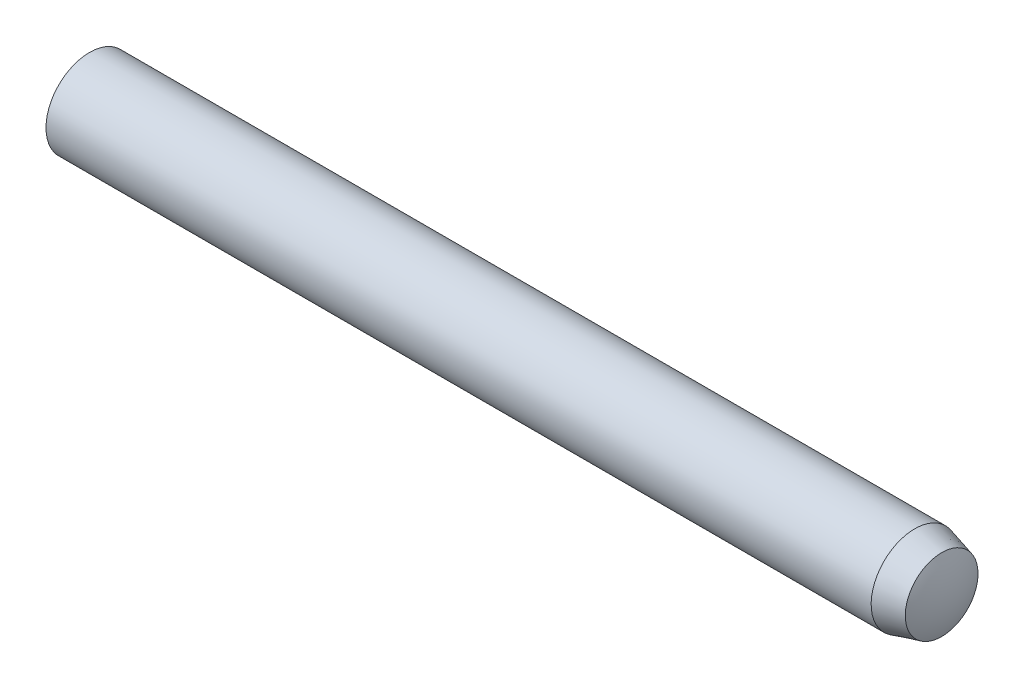
ISO-10303-21;
HEADER;
FILE_DESCRIPTION(('STEP AP214'),'2;1');
FILE_NAME('part.step','',(''),(''),'','','');
FILE_SCHEMA(('AUTOMOTIVE_DESIGN { 1 0 10303 214 1 1 1 1 }'));
ENDSEC;
DATA;
#1=APPLICATION_CONTEXT('core data for automotive mechanical design processes');
#2=APPLICATION_PROTOCOL_DEFINITION('international standard','automotive_design',2000,#1);
#3=PRODUCT_CONTEXT('',#1,'mechanical');
#4=PRODUCT('Part','Part','',(#3));
#5=PRODUCT_RELATED_PRODUCT_CATEGORY('part','',(#4));
#6=PRODUCT_DEFINITION_FORMATION('','',#4);
#7=PRODUCT_DEFINITION_CONTEXT('part definition',#1,'design');
#8=PRODUCT_DEFINITION('design','',#6,#7);
#9=PRODUCT_DEFINITION_SHAPE('','',#8);
#10=(LENGTH_UNIT() NAMED_UNIT(*) SI_UNIT(.MILLI.,.METRE.));
#11=(NAMED_UNIT(*) PLANE_ANGLE_UNIT() SI_UNIT($,.RADIAN.));
#12=(NAMED_UNIT(*) SI_UNIT($,.STERADIAN.) SOLID_ANGLE_UNIT());
#13=UNCERTAINTY_MEASURE_WITH_UNIT(LENGTH_MEASURE(1.E-05),#10,'distance_accuracy_value','');
#14=(GEOMETRIC_REPRESENTATION_CONTEXT(3) GLOBAL_UNCERTAINTY_ASSIGNED_CONTEXT((#13)) GLOBAL_UNIT_ASSIGNED_CONTEXT((#10,
#11,#12)) REPRESENTATION_CONTEXT('',''));
#15=CARTESIAN_POINT('',(0.,0.,0.));
#16=DIRECTION('',(0.,0.,1.));
#17=DIRECTION('',(1.,0.,0.));
#18=AXIS2_PLACEMENT_3D('',#15,#16,#17);
#19=CARTESIAN_POINT('',(3.0125,0.,0.));
#20=DIRECTION('',(-1.,0.,0.));
#21=DIRECTION('',(0.,1.,0.));
#22=AXIS2_PLACEMENT_3D('',#19,#20,#21);
#23=SPHERICAL_SURFACE('',#22,3.0125);
#24=CARTESIAN_POINT('',(0.4,0.,0.));
#25=DIRECTION('',(-1.,0.,0.));
#26=DIRECTION('',(0.,-1.,0.));
#27=AXIS2_PLACEMENT_3D('',#24,#25,#26);
#28=CIRCLE('',#27,1.5);
#29=CARTESIAN_POINT('',(0.4,-1.5,0.));
#30=VERTEX_POINT('',#29);
#31=EDGE_CURVE('E41',#30,#30,#28,.T.);
#32=ORIENTED_EDGE('',*,*,#31,.T.);
#33=EDGE_LOOP('',(#32));
#34=FACE_BOUND('',#33,.T.);
#35=ADVANCED_FACE('F31',(#34),#23,.T.);
#36=CARTESIAN_POINT('',(27.,0.,0.));
#37=DIRECTION('',(-1.,0.,0.));
#38=DIRECTION('',(0.,-1.,0.));
#39=AXIS2_PLACEMENT_3D('',#36,#37,#38);
#40=SPHERICAL_SURFACE('',#39,3.);
#41=CARTESIAN_POINT('',(29.7263603152597,0.,0.));
#42=DIRECTION('',(-1.,0.,0.));
#43=DIRECTION('',(0.,-1.,0.));
#44=AXIS2_PLACEMENT_3D('',#41,#42,#43);
#45=CIRCLE('',#44,1.25178250162591);
#46=CARTESIAN_POINT('',(29.7263603152597,-1.25178250162591,0.));
#47=VERTEX_POINT('',#46);
#48=EDGE_CURVE('E10',#47,#47,#45,.T.);
#49=ORIENTED_EDGE('',*,*,#48,.F.);
#50=EDGE_LOOP('',(#49));
#51=FACE_BOUND('',#50,.T.);
#52=ADVANCED_FACE('F56',(#51),#40,.T.);
#53=CARTESIAN_POINT('',(29.7263603152597,0.,0.));
#54=DIRECTION('',(-1.,0.,0.));
#55=DIRECTION('',(0.,-1.,0.));
#56=AXIS2_PLACEMENT_3D('',#53,#54,#55);
#57=CONICAL_SURFACE('',#56,1.25178250162591,0.261799387799151);
#58=CARTESIAN_POINT('',(28.8,0.,0.));
#59=DIRECTION('',(-1.,0.,0.));
#60=DIRECTION('',(0.,-1.,0.));
#61=AXIS2_PLACEMENT_3D('',#58,#59,#60);
#62=CIRCLE('',#61,1.5);
#63=CARTESIAN_POINT('',(28.8,-1.5,0.));
#64=VERTEX_POINT('',#63);
#65=EDGE_CURVE('E37',#64,#64,#62,.T.);
#66=ORIENTED_EDGE('',*,*,#65,.F.);
#67=EDGE_LOOP('',(#66));
#68=FACE_BOUND('',#67,.T.);
#69=ORIENTED_EDGE('',*,*,#48,.T.);
#70=EDGE_LOOP('',(#69));
#71=FACE_BOUND('',#70,.T.);
#72=ADVANCED_FACE('F51',(#68,#71),#57,.T.);
#73=CARTESIAN_POINT('',(0.,0.,0.));
#74=DIRECTION('',(-1.,0.,0.));
#75=DIRECTION('',(0.,-1.,0.));
#76=AXIS2_PLACEMENT_3D('',#73,#74,#75);
#77=CYLINDRICAL_SURFACE('',#76,1.5);
#78=ORIENTED_EDGE('',*,*,#31,.F.);
#79=EDGE_LOOP('',(#78));
#80=FACE_BOUND('',#79,.T.);
#81=ORIENTED_EDGE('',*,*,#65,.T.);
#82=EDGE_LOOP('',(#81));
#83=FACE_BOUND('',#82,.T.);
#84=ADVANCED_FACE('F49',(#80,#83),#77,.T.);
#85=CLOSED_SHELL('',(#35,#52,#72,#84));
#86=MANIFOLD_SOLID_BREP('B2',#85);
#87=ADVANCED_BREP_SHAPE_REPRESENTATION('',(#18,#86),#14);
#88=SHAPE_DEFINITION_REPRESENTATION(#9,#87);
ENDSEC;
END-ISO-10303-21;
